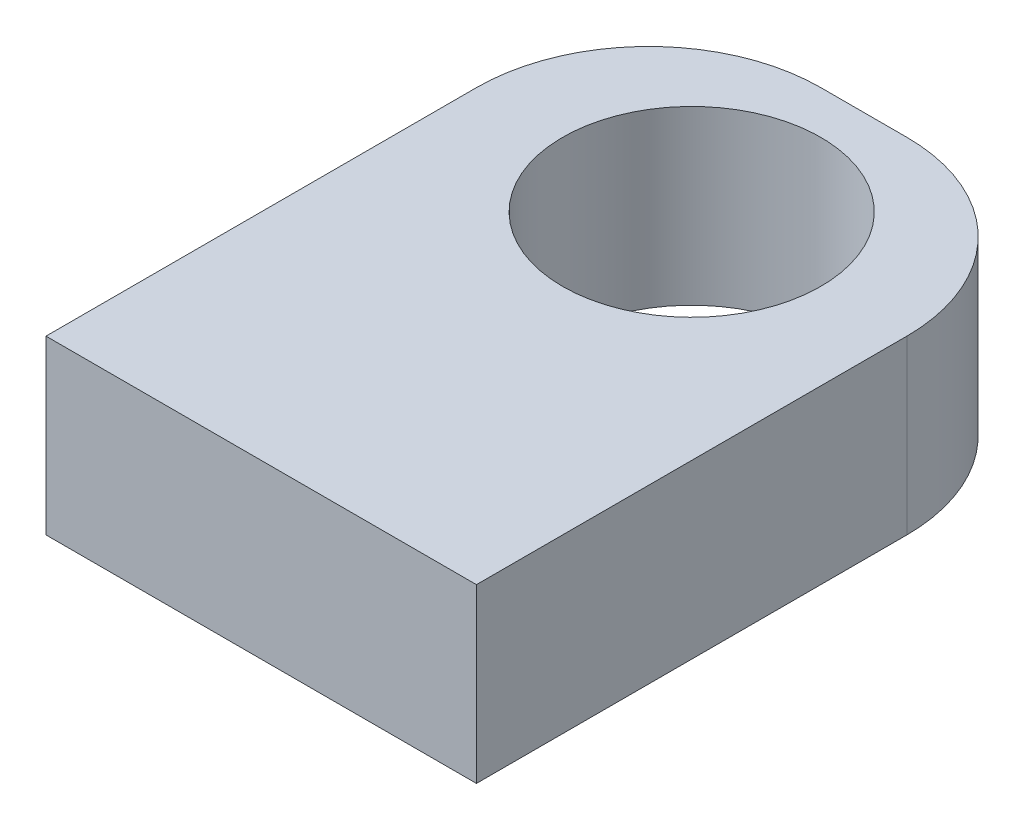
ISO-10303-21;
HEADER;
FILE_DESCRIPTION(('STEP AP214'),'2;1');
FILE_NAME('part.step','',(''),(''),'','','');
FILE_SCHEMA(('AUTOMOTIVE_DESIGN { 1 0 10303 214 1 1 1 1 }'));
ENDSEC;
DATA;
#1=APPLICATION_CONTEXT('core data for automotive mechanical design processes');
#2=APPLICATION_PROTOCOL_DEFINITION('international standard','automotive_design',2000,#1);
#3=PRODUCT_CONTEXT('',#1,'mechanical');
#4=PRODUCT('Part','Part','',(#3));
#5=PRODUCT_RELATED_PRODUCT_CATEGORY('part','',(#4));
#6=PRODUCT_DEFINITION_FORMATION('','',#4);
#7=PRODUCT_DEFINITION_CONTEXT('part definition',#1,'design');
#8=PRODUCT_DEFINITION('design','',#6,#7);
#9=PRODUCT_DEFINITION_SHAPE('','',#8);
#10=(LENGTH_UNIT() NAMED_UNIT(*) SI_UNIT(.MILLI.,.METRE.));
#11=(NAMED_UNIT(*) PLANE_ANGLE_UNIT() SI_UNIT($,.RADIAN.));
#12=(NAMED_UNIT(*) SI_UNIT($,.STERADIAN.) SOLID_ANGLE_UNIT());
#13=UNCERTAINTY_MEASURE_WITH_UNIT(LENGTH_MEASURE(1.E-05),#10,'distance_accuracy_value','');
#14=(GEOMETRIC_REPRESENTATION_CONTEXT(3) GLOBAL_UNCERTAINTY_ASSIGNED_CONTEXT((#13)) GLOBAL_UNIT_ASSIGNED_CONTEXT((#10,
#11,#12)) REPRESENTATION_CONTEXT('',''));
#15=CARTESIAN_POINT('',(0.,0.,0.));
#16=DIRECTION('',(0.,0.,1.));
#17=DIRECTION('',(1.,0.,0.));
#18=AXIS2_PLACEMENT_3D('',#15,#16,#17);
#19=CARTESIAN_POINT('',(-2.49999999999973,322.000000000002,-45.0000000000028));
#20=DIRECTION('',(0.,1.00000000000001,0.));
#21=DIRECTION('',(0.,0.,1.));
#22=AXIS2_PLACEMENT_3D('',#19,#20,#21);
#23=CYLINDRICAL_SURFACE('',#22,10.);
#24=CARTESIAN_POINT('',(-2.49999999999973,322.000000000002,-45.0000000000028));
#25=DIRECTION('',(0.,1.00000000000001,0.));
#26=DIRECTION('',(0.,0.,1.));
#27=AXIS2_PLACEMENT_3D('',#24,#25,#26);
#28=CIRCLE('',#27,10.);
#29=CARTESIAN_POINT('',(-2.49999999999728,322.000000000002,-55.0000000000028));
#30=VERTEX_POINT('',#29);
#31=CARTESIAN_POINT('',(-12.4999999999997,322.000000000002,-45.0000000000004));
#32=VERTEX_POINT('',#31);
#33=EDGE_CURVE('E121',#30,#32,#28,.T.);
#34=ORIENTED_EDGE('',*,*,#33,.F.);
#35=DIRECTION('',(0.,1.00000000000001,0.));
#36=VECTOR('',#35,1.);
#37=CARTESIAN_POINT('',(-2.49999999999728,312.000000000002,-55.0000000000028));
#38=LINE('',#37,#36);
#39=CARTESIAN_POINT('',(-2.49999999999728,312.000000000002,-55.0000000000028));
#40=VERTEX_POINT('',#39);
#41=EDGE_CURVE('E175',#40,#30,#38,.T.);
#42=ORIENTED_EDGE('',*,*,#41,.F.);
#43=CARTESIAN_POINT('',(-2.49999999999973,312.000000000002,-45.0000000000028));
#44=DIRECTION('',(0.,1.00000000000001,0.));
#45=DIRECTION('',(0.,0.,1.));
#46=AXIS2_PLACEMENT_3D('',#43,#44,#45);
#47=CIRCLE('',#46,10.);
#48=CARTESIAN_POINT('',(-12.4999999999997,312.000000000002,-45.0000000000004));
#49=VERTEX_POINT('',#48);
#50=EDGE_CURVE('E100',#40,#49,#47,.T.);
#51=ORIENTED_EDGE('',*,*,#50,.T.);
#52=DIRECTION('',(0.,1.00000000000001,0.));
#53=VECTOR('',#52,1.);
#54=CARTESIAN_POINT('',(-12.4999999999997,322.000000000002,-45.0000000000004));
#55=LINE('',#54,#53);
#56=EDGE_CURVE('E13',#49,#32,#55,.T.);
#57=ORIENTED_EDGE('',*,*,#56,.T.);
#58=EDGE_LOOP('',(#34,#42,#51,#57));
#59=FACE_BOUND('',#58,.T.);
#60=ADVANCED_FACE('F63',(#59),#23,.T.);
#61=CARTESIAN_POINT('',(-12.4999999999997,322.000000000002,-20.0000000000002));
#62=DIRECTION('',(0.999999999999996,0.,0.));
#63=DIRECTION('',(0.,0.,-1.));
#64=AXIS2_PLACEMENT_3D('',#61,#62,#63);
#65=PLANE('',#64);
#66=ORIENTED_EDGE('',*,*,#56,.F.);
#67=DIRECTION('',(0.,0.,1.));
#68=VECTOR('',#67,1.);
#69=CARTESIAN_POINT('',(-12.4999999999997,312.000000000002,-2.22044604925031E-13));
#70=LINE('',#69,#68);
#71=CARTESIAN_POINT('',(-12.4999999999997,312.000000000002,-20.0000000000002));
#72=VERTEX_POINT('',#71);
#73=EDGE_CURVE('E185',#72,#49,#70,.F.);
#74=ORIENTED_EDGE('',*,*,#73,.F.);
#75=DIRECTION('',(0.,1.00000000000001,0.));
#76=VECTOR('',#75,1.);
#77=CARTESIAN_POINT('',(-12.4999999999997,322.000000000002,-20.0000000000002));
#78=LINE('',#77,#76);
#79=CARTESIAN_POINT('',(-12.4999999999997,322.000000000002,-20.0000000000002));
#80=VERTEX_POINT('',#79);
#81=EDGE_CURVE('E72',#72,#80,#78,.T.);
#82=ORIENTED_EDGE('',*,*,#81,.T.);
#83=DIRECTION('',(0.,0.,-1.));
#84=VECTOR('',#83,1.);
#85=CARTESIAN_POINT('',(-12.4999999999997,322.000000000002,-20.0000000000002));
#86=LINE('',#85,#84);
#87=EDGE_CURVE('E188',#80,#32,#86,.T.);
#88=ORIENTED_EDGE('',*,*,#87,.T.);
#89=EDGE_LOOP('',(#66,#74,#82,#88));
#90=FACE_BOUND('',#89,.T.);
#91=ADVANCED_FACE('F244',(#90),#65,.F.);
#92=CARTESIAN_POINT('',(12.5000000000004,322.000000000002,-20.0000000000002));
#93=DIRECTION('',(0.,0.,-1.));
#94=DIRECTION('',(-0.999999999999996,0.,0.));
#95=AXIS2_PLACEMENT_3D('',#92,#93,#94);
#96=PLANE('',#95);
#97=ORIENTED_EDGE('',*,*,#81,.F.);
#98=DIRECTION('',(0.999999999999996,0.,0.));
#99=VECTOR('',#98,1.);
#100=CARTESIAN_POINT('',(2.22044604925031E-13,312.000000000002,-20.0000000000005));
#101=LINE('',#100,#99);
#102=CARTESIAN_POINT('',(12.5,312.000000000002,-20.0000000000002));
#103=VERTEX_POINT('',#102);
#104=EDGE_CURVE('E125',#103,#72,#101,.F.);
#105=ORIENTED_EDGE('',*,*,#104,.F.);
#106=DIRECTION('',(0.,1.00000000000001,0.));
#107=VECTOR('',#106,1.);
#108=CARTESIAN_POINT('',(12.5,312.000000000002,-20.0000000000002));
#109=LINE('',#108,#107);
#110=CARTESIAN_POINT('',(12.5000000000004,322.000000000002,-20.0000000000002));
#111=VERTEX_POINT('',#110);
#112=EDGE_CURVE('E143',#103,#111,#109,.T.);
#113=ORIENTED_EDGE('',*,*,#112,.T.);
#114=DIRECTION('',(-0.999999999999996,0.,0.));
#115=VECTOR('',#114,1.);
#116=CARTESIAN_POINT('',(12.5000000000004,322.000000000002,-20.0000000000002));
#117=LINE('',#116,#115);
#118=EDGE_CURVE('E182',#111,#80,#117,.T.);
#119=ORIENTED_EDGE('',*,*,#118,.T.);
#120=EDGE_LOOP('',(#97,#105,#113,#119));
#121=FACE_BOUND('',#120,.T.);
#122=ADVANCED_FACE('F236',(#121),#96,.F.);
#123=CARTESIAN_POINT('',(2.66453525910038E-12,322.000000000002,-2.22044604925031E-13));
#124=DIRECTION('',(0.,1.00000000000001,0.));
#125=DIRECTION('',(0.,0.,1.));
#126=AXIS2_PLACEMENT_3D('',#123,#124,#125);
#127=PLANE('',#126);
#128=ORIENTED_EDGE('',*,*,#118,.F.);
#129=DIRECTION('',(0.,0.,-1.));
#130=VECTOR('',#129,1.);
#131=CARTESIAN_POINT('',(12.5000000000004,322.000000000002,-20.0000000000002));
#132=LINE('',#131,#130);
#133=CARTESIAN_POINT('',(12.5000000000002,322.000000000002,-45.0000000000001));
#134=VERTEX_POINT('',#133);
#135=EDGE_CURVE('E169',#111,#134,#132,.T.);
#136=ORIENTED_EDGE('',*,*,#135,.T.);
#137=CARTESIAN_POINT('',(2.50000000000039,322.000000000002,-45.0000000000028));
#138=DIRECTION('',(0.,1.00000000000001,0.));
#139=DIRECTION('',(0.,0.,-1.));
#140=AXIS2_PLACEMENT_3D('',#137,#138,#139);
#141=CIRCLE('',#140,10.);
#142=CARTESIAN_POINT('',(2.50000000000261,322.000000000002,-55.0000000000028));
#143=VERTEX_POINT('',#142);
#144=EDGE_CURVE('E136',#134,#143,#141,.T.);
#145=ORIENTED_EDGE('',*,*,#144,.T.);
#146=DIRECTION('',(-0.999999999999996,0.,0.));
#147=VECTOR('',#146,1.);
#148=CARTESIAN_POINT('',(-2.49999999999728,322.000000000002,-55.0000000000028));
#149=LINE('',#148,#147);
#150=EDGE_CURVE('E155',#143,#30,#149,.T.);
#151=ORIENTED_EDGE('',*,*,#150,.T.);
#152=ORIENTED_EDGE('',*,*,#33,.T.);
#153=ORIENTED_EDGE('',*,*,#87,.F.);
#154=EDGE_LOOP('',(#128,#136,#145,#151,#152,#153));
#155=FACE_BOUND('',#154,.T.);
#156=CARTESIAN_POINT('',(2.22044604925031E-13,322.000000000002,-45.0000000000004));
#157=DIRECTION('',(0.,1.00000000000001,0.));
#158=DIRECTION('',(0.,0.,1.));
#159=AXIS2_PLACEMENT_3D('',#156,#157,#158);
#160=CIRCLE('',#159,7.5);
#161=CARTESIAN_POINT('',(2.17831792368673E-13,322.000000000002,-37.5000000000004));
#162=VERTEX_POINT('',#161);
#163=EDGE_CURVE('E164',#162,#162,#160,.T.);
#164=ORIENTED_EDGE('',*,*,#163,.F.);
#165=EDGE_LOOP('',(#164));
#166=FACE_BOUND('',#165,.T.);
#167=ADVANCED_FACE('F234',(#155,#166),#127,.T.);
#168=CARTESIAN_POINT('',(2.22044604925031E-13,312.000000000002,-2.22044604925031E-13));
#169=DIRECTION('',(0.,1.00000000000001,0.));
#170=DIRECTION('',(0.,0.,1.));
#171=AXIS2_PLACEMENT_3D('',#168,#169,#170);
#172=PLANE('',#171);
#173=ORIENTED_EDGE('',*,*,#104,.T.);
#174=ORIENTED_EDGE('',*,*,#73,.T.);
#175=ORIENTED_EDGE('',*,*,#50,.F.);
#176=DIRECTION('',(-0.999999999999996,0.,0.));
#177=VECTOR('',#176,1.);
#178=CARTESIAN_POINT('',(-2.49999999999728,312.000000000002,-55.0000000000028));
#179=LINE('',#178,#177);
#180=CARTESIAN_POINT('',(2.50000000000239,312.000000000002,-55.0000000000028));
#181=VERTEX_POINT('',#180);
#182=EDGE_CURVE('E150',#181,#40,#179,.T.);
#183=ORIENTED_EDGE('',*,*,#182,.F.);
#184=CARTESIAN_POINT('',(2.50000000000017,312.000000000002,-45.0000000000028));
#185=DIRECTION('',(0.,1.00000000000001,0.));
#186=DIRECTION('',(0.,0.,-1.));
#187=AXIS2_PLACEMENT_3D('',#184,#185,#186);
#188=CIRCLE('',#187,10.);
#189=CARTESIAN_POINT('',(12.5,312.000000000002,-45.0000000000001));
#190=VERTEX_POINT('',#189);
#191=EDGE_CURVE('E134',#190,#181,#188,.T.);
#192=ORIENTED_EDGE('',*,*,#191,.F.);
#193=DIRECTION('',(0.,0.,-1.));
#194=VECTOR('',#193,1.);
#195=CARTESIAN_POINT('',(12.5,312.000000000002,-20.0000000000002));
#196=LINE('',#195,#194);
#197=EDGE_CURVE('E148',#103,#190,#196,.T.);
#198=ORIENTED_EDGE('',*,*,#197,.F.);
#199=EDGE_LOOP('',(#173,#174,#175,#183,#192,#198));
#200=FACE_BOUND('',#199,.T.);
#201=CARTESIAN_POINT('',(2.22044604925031E-13,312.000000000002,-45.0000000000004));
#202=DIRECTION('',(0.,1.00000000000001,0.));
#203=DIRECTION('',(0.,0.,1.));
#204=AXIS2_PLACEMENT_3D('',#201,#202,#203);
#205=CIRCLE('',#204,7.5);
#206=CARTESIAN_POINT('',(2.17831792368673E-13,312.000000000002,-37.5000000000004));
#207=VERTEX_POINT('',#206);
#208=EDGE_CURVE('E172',#207,#207,#205,.T.);
#209=ORIENTED_EDGE('',*,*,#208,.T.);
#210=EDGE_LOOP('',(#209));
#211=FACE_BOUND('',#210,.T.);
#212=ADVANCED_FACE('F146',(#200,#211),#172,.F.);
#213=CARTESIAN_POINT('',(-2.49999999999728,312.000000000002,-55.0000000000028));
#214=DIRECTION('',(0.,0.,-1.));
#215=DIRECTION('',(-0.999999999999996,0.,0.));
#216=AXIS2_PLACEMENT_3D('',#213,#214,#215);
#217=PLANE('',#216);
#218=ORIENTED_EDGE('',*,*,#150,.F.);
#219=DIRECTION('',(0.,1.00000000000001,0.));
#220=VECTOR('',#219,1.);
#221=CARTESIAN_POINT('',(2.50000000000239,312.000000000002,-55.0000000000028));
#222=LINE('',#221,#220);
#223=EDGE_CURVE('E142',#181,#143,#222,.T.);
#224=ORIENTED_EDGE('',*,*,#223,.F.);
#225=ORIENTED_EDGE('',*,*,#182,.T.);
#226=ORIENTED_EDGE('',*,*,#41,.T.);
#227=EDGE_LOOP('',(#218,#224,#225,#226));
#228=FACE_BOUND('',#227,.T.);
#229=ADVANCED_FACE('F241',(#228),#217,.T.);
#230=CARTESIAN_POINT('',(2.50000000000017,312.000000000002,-45.0000000000028));
#231=DIRECTION('',(0.,1.00000000000001,0.));
#232=DIRECTION('',(0.,0.,1.));
#233=AXIS2_PLACEMENT_3D('',#230,#231,#232);
#234=CYLINDRICAL_SURFACE('',#233,10.);
#235=ORIENTED_EDGE('',*,*,#144,.F.);
#236=DIRECTION('',(0.,1.00000000000001,0.));
#237=VECTOR('',#236,1.);
#238=CARTESIAN_POINT('',(12.5,312.000000000002,-45.0000000000001));
#239=LINE('',#238,#237);
#240=EDGE_CURVE('E131',#190,#134,#239,.T.);
#241=ORIENTED_EDGE('',*,*,#240,.F.);
#242=ORIENTED_EDGE('',*,*,#191,.T.);
#243=ORIENTED_EDGE('',*,*,#223,.T.);
#244=EDGE_LOOP('',(#235,#241,#242,#243));
#245=FACE_BOUND('',#244,.T.);
#246=ADVANCED_FACE('F133',(#245),#234,.T.);
#247=CARTESIAN_POINT('',(12.5,312.000000000002,-20.0000000000002));
#248=DIRECTION('',(0.999999999999996,0.,0.));
#249=DIRECTION('',(0.,0.,-1.));
#250=AXIS2_PLACEMENT_3D('',#247,#248,#249);
#251=PLANE('',#250);
#252=ORIENTED_EDGE('',*,*,#135,.F.);
#253=ORIENTED_EDGE('',*,*,#112,.F.);
#254=ORIENTED_EDGE('',*,*,#197,.T.);
#255=ORIENTED_EDGE('',*,*,#240,.T.);
#256=EDGE_LOOP('',(#252,#253,#254,#255));
#257=FACE_BOUND('',#256,.T.);
#258=ADVANCED_FACE('F153',(#257),#251,.T.);
#259=CARTESIAN_POINT('',(2.22044604925031E-13,312.000000000002,-45.0000000000004));
#260=DIRECTION('',(0.,1.00000000000001,0.));
#261=DIRECTION('',(0.,0.,1.));
#262=AXIS2_PLACEMENT_3D('',#259,#260,#261);
#263=CYLINDRICAL_SURFACE('',#262,7.5);
#264=ORIENTED_EDGE('',*,*,#208,.F.);
#265=EDGE_LOOP('',(#264));
#266=FACE_BOUND('',#265,.T.);
#267=ORIENTED_EDGE('',*,*,#163,.T.);
#268=EDGE_LOOP('',(#267));
#269=FACE_BOUND('',#268,.T.);
#270=ADVANCED_FACE('F232',(#266,#269),#263,.F.);
#271=CLOSED_SHELL('',(#60,#91,#122,#167,#212,#229,#246,#258,#270));
#272=MANIFOLD_SOLID_BREP('B2',#271);
#273=ADVANCED_BREP_SHAPE_REPRESENTATION('',(#18,#272),#14);
#274=SHAPE_DEFINITION_REPRESENTATION(#9,#273);
ENDSEC;
END-ISO-10303-21;
